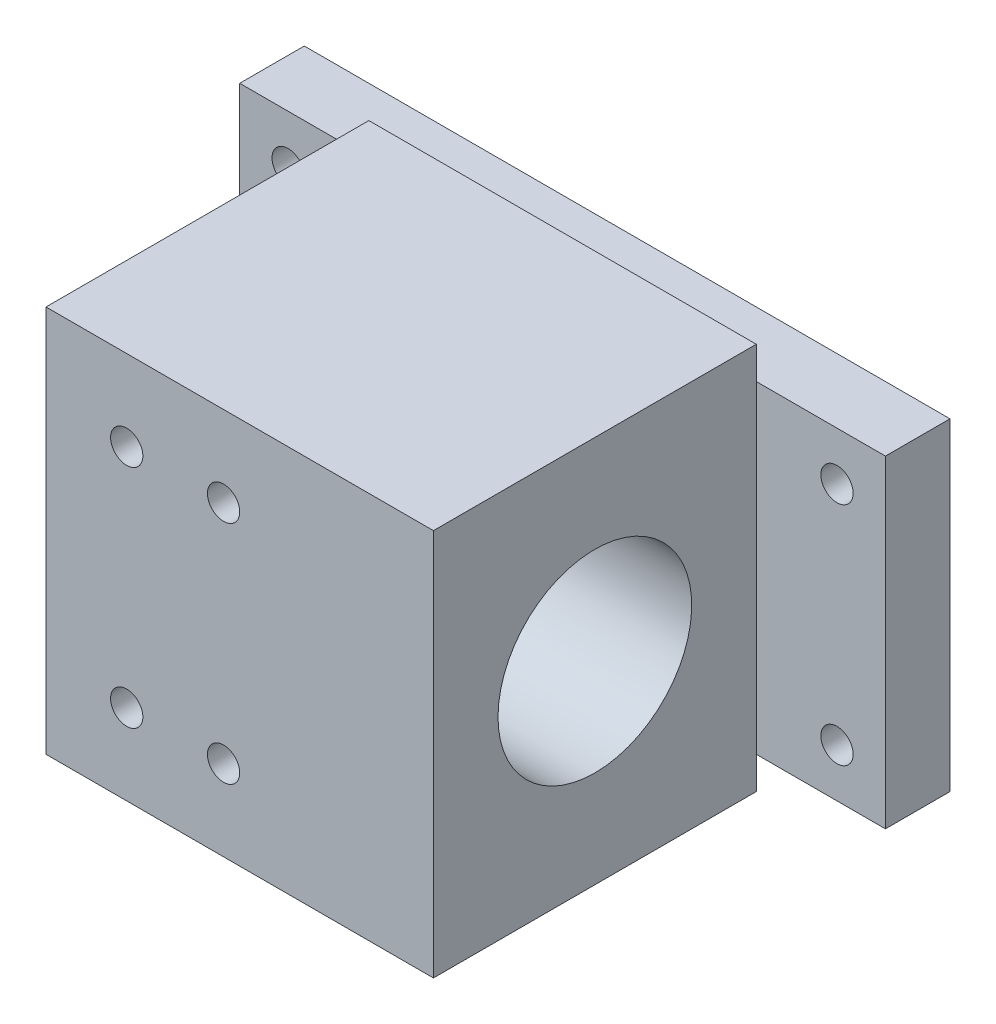
ISO-10303-21;
HEADER;
FILE_DESCRIPTION(('STEP AP214'),'2;1');
FILE_NAME('part.step','',(''),(''),'','','');
FILE_SCHEMA(('AUTOMOTIVE_DESIGN { 1 0 10303 214 1 1 1 1 }'));
ENDSEC;
DATA;
#1=APPLICATION_CONTEXT('core data for automotive mechanical design processes');
#2=APPLICATION_PROTOCOL_DEFINITION('international standard','automotive_design',2000,#1);
#3=PRODUCT_CONTEXT('',#1,'mechanical');
#4=PRODUCT('Part','Part','',(#3));
#5=PRODUCT_RELATED_PRODUCT_CATEGORY('part','',(#4));
#6=PRODUCT_DEFINITION_FORMATION('','',#4);
#7=PRODUCT_DEFINITION_CONTEXT('part definition',#1,'design');
#8=PRODUCT_DEFINITION('design','',#6,#7);
#9=PRODUCT_DEFINITION_SHAPE('','',#8);
#10=(LENGTH_UNIT() NAMED_UNIT(*) SI_UNIT(.MILLI.,.METRE.));
#11=(NAMED_UNIT(*) PLANE_ANGLE_UNIT() SI_UNIT($,.RADIAN.));
#12=(NAMED_UNIT(*) SI_UNIT($,.STERADIAN.) SOLID_ANGLE_UNIT());
#13=UNCERTAINTY_MEASURE_WITH_UNIT(LENGTH_MEASURE(1.E-05),#10,'distance_accuracy_value','');
#14=(GEOMETRIC_REPRESENTATION_CONTEXT(3) GLOBAL_UNCERTAINTY_ASSIGNED_CONTEXT((#13)) GLOBAL_UNIT_ASSIGNED_CONTEXT((#10,
#11,#12)) REPRESENTATION_CONTEXT('',''));
#15=CARTESIAN_POINT('',(0.,0.,0.));
#16=DIRECTION('',(0.,0.,1.));
#17=DIRECTION('',(1.,0.,0.));
#18=AXIS2_PLACEMENT_3D('',#15,#16,#17);
#19=CARTESIAN_POINT('',(0.,0.,10.));
#20=DIRECTION('',(0.,0.,1.));
#21=DIRECTION('',(1.,0.,0.));
#22=AXIS2_PLACEMENT_3D('',#19,#20,#21);
#23=PLANE('',#22);
#24=DIRECTION('',(0.,1.,0.));
#25=VECTOR('',#24,1.);
#26=CARTESIAN_POINT('',(30.,30.,10.));
#27=LINE('',#26,#25);
#28=CARTESIAN_POINT('',(30.,-25.,10.));
#29=VERTEX_POINT('',#28);
#30=CARTESIAN_POINT('',(30.,25.,10.));
#31=VERTEX_POINT('',#30);
#32=EDGE_CURVE('E11',#29,#31,#27,.T.);
#33=ORIENTED_EDGE('',*,*,#32,.F.);
#34=DIRECTION('',(1.,0.,0.));
#35=VECTOR('',#34,1.);
#36=CARTESIAN_POINT('',(-50.,-25.,10.));
#37=LINE('',#36,#35);
#38=CARTESIAN_POINT('',(50.,-25.,10.));
#39=VERTEX_POINT('',#38);
#40=EDGE_CURVE('E202',#29,#39,#37,.T.);
#41=ORIENTED_EDGE('',*,*,#40,.T.);
#42=DIRECTION('',(0.,1.,0.));
#43=VECTOR('',#42,1.);
#44=CARTESIAN_POINT('',(50.,25.,10.));
#45=LINE('',#44,#43);
#46=CARTESIAN_POINT('',(50.,25.,10.));
#47=VERTEX_POINT('',#46);
#48=EDGE_CURVE('E189',#39,#47,#45,.T.);
#49=ORIENTED_EDGE('',*,*,#48,.T.);
#50=DIRECTION('',(-1.,0.,0.));
#51=VECTOR('',#50,1.);
#52=CARTESIAN_POINT('',(-50.,25.,10.));
#53=LINE('',#52,#51);
#54=EDGE_CURVE('E195',#47,#31,#53,.T.);
#55=ORIENTED_EDGE('',*,*,#54,.T.);
#56=EDGE_LOOP('',(#33,#41,#49,#55));
#57=FACE_BOUND('',#56,.T.);
#58=CARTESIAN_POINT('',(42.5,17.5,10.));
#59=DIRECTION('',(0.,0.,1.));
#60=DIRECTION('',(1.,0.,0.));
#61=AXIS2_PLACEMENT_3D('',#58,#59,#60);
#62=CIRCLE('',#61,2.50000000000001);
#63=CARTESIAN_POINT('',(45.,17.5,10.));
#64=VERTEX_POINT('',#63);
#65=EDGE_CURVE('E173',#64,#64,#62,.T.);
#66=ORIENTED_EDGE('',*,*,#65,.F.);
#67=EDGE_LOOP('',(#66));
#68=FACE_BOUND('',#67,.T.);
#69=CARTESIAN_POINT('',(42.5,-17.5,10.));
#70=DIRECTION('',(0.,0.,1.));
#71=DIRECTION('',(1.,0.,0.));
#72=AXIS2_PLACEMENT_3D('',#69,#70,#71);
#73=CIRCLE('',#72,2.5);
#74=CARTESIAN_POINT('',(45.,-17.5,10.));
#75=VERTEX_POINT('',#74);
#76=EDGE_CURVE('E165',#75,#75,#73,.T.);
#77=ORIENTED_EDGE('',*,*,#76,.F.);
#78=EDGE_LOOP('',(#77));
#79=FACE_BOUND('',#78,.T.);
#80=ADVANCED_FACE('F42',(#57,#68,#79),#23,.T.);
#81=DIRECTION('',(0.,-1.,0.));
#82=VECTOR('',#81,1.);
#83=CARTESIAN_POINT('',(-30.,30.,10.));
#84=LINE('',#83,#82);
#85=CARTESIAN_POINT('',(-30.,25.,10.));
#86=VERTEX_POINT('',#85);
#87=CARTESIAN_POINT('',(-30.,-25.,10.));
#88=VERTEX_POINT('',#87);
#89=EDGE_CURVE('E52',#86,#88,#84,.T.);
#90=ORIENTED_EDGE('',*,*,#89,.F.);
#91=CARTESIAN_POINT('',(-50.,25.,10.));
#92=VERTEX_POINT('',#91);
#93=EDGE_CURVE('E193',#86,#92,#53,.T.);
#94=ORIENTED_EDGE('',*,*,#93,.T.);
#95=DIRECTION('',(0.,-1.,0.));
#96=VECTOR('',#95,1.);
#97=CARTESIAN_POINT('',(-50.,25.,10.));
#98=LINE('',#97,#96);
#99=CARTESIAN_POINT('',(-50.,-25.,10.));
#100=VERTEX_POINT('',#99);
#101=EDGE_CURVE('E198',#92,#100,#98,.T.);
#102=ORIENTED_EDGE('',*,*,#101,.T.);
#103=EDGE_CURVE('E203',#100,#88,#37,.T.);
#104=ORIENTED_EDGE('',*,*,#103,.T.);
#105=EDGE_LOOP('',(#90,#94,#102,#104));
#106=FACE_BOUND('',#105,.T.);
#107=CARTESIAN_POINT('',(-42.5,17.5,10.));
#108=DIRECTION('',(0.,0.,1.));
#109=DIRECTION('',(1.,0.,0.));
#110=AXIS2_PLACEMENT_3D('',#107,#108,#109);
#111=CIRCLE('',#110,2.50000000000001);
#112=CARTESIAN_POINT('',(-40.,17.5,10.));
#113=VERTEX_POINT('',#112);
#114=EDGE_CURVE('E181',#113,#113,#111,.T.);
#115=ORIENTED_EDGE('',*,*,#114,.F.);
#116=EDGE_LOOP('',(#115));
#117=FACE_BOUND('',#116,.T.);
#118=CARTESIAN_POINT('',(-42.5,-17.5,10.));
#119=DIRECTION('',(0.,0.,1.));
#120=DIRECTION('',(1.,0.,0.));
#121=AXIS2_PLACEMENT_3D('',#118,#119,#120);
#122=CIRCLE('',#121,2.5);
#123=CARTESIAN_POINT('',(-40.,-17.5,10.));
#124=VERTEX_POINT('',#123);
#125=EDGE_CURVE('E155',#124,#124,#122,.T.);
#126=ORIENTED_EDGE('',*,*,#125,.F.);
#127=EDGE_LOOP('',(#126));
#128=FACE_BOUND('',#127,.T.);
#129=ADVANCED_FACE('F324',(#106,#117,#128),#23,.T.);
#130=CARTESIAN_POINT('',(0.,0.,0.));
#131=DIRECTION('',(0.,0.,1.));
#132=DIRECTION('',(1.,0.,0.));
#133=AXIS2_PLACEMENT_3D('',#130,#131,#132);
#134=PLANE('',#133);
#135=DIRECTION('',(0.,1.,0.));
#136=VECTOR('',#135,1.);
#137=CARTESIAN_POINT('',(50.,25.,0.));
#138=LINE('',#137,#136);
#139=CARTESIAN_POINT('',(50.,-25.,0.));
#140=VERTEX_POINT('',#139);
#141=CARTESIAN_POINT('',(50.,25.,0.));
#142=VERTEX_POINT('',#141);
#143=EDGE_CURVE('E185',#140,#142,#138,.T.);
#144=ORIENTED_EDGE('',*,*,#143,.F.);
#145=DIRECTION('',(1.,0.,0.));
#146=VECTOR('',#145,1.);
#147=CARTESIAN_POINT('',(-50.,-25.,0.));
#148=LINE('',#147,#146);
#149=CARTESIAN_POINT('',(-50.,-25.,0.));
#150=VERTEX_POINT('',#149);
#151=EDGE_CURVE('E194',#150,#140,#148,.T.);
#152=ORIENTED_EDGE('',*,*,#151,.F.);
#153=DIRECTION('',(0.,-1.,0.));
#154=VECTOR('',#153,1.);
#155=CARTESIAN_POINT('',(-50.,25.,0.));
#156=LINE('',#155,#154);
#157=CARTESIAN_POINT('',(-50.,25.,0.));
#158=VERTEX_POINT('',#157);
#159=EDGE_CURVE('E214',#158,#150,#156,.T.);
#160=ORIENTED_EDGE('',*,*,#159,.F.);
#161=DIRECTION('',(-1.,0.,0.));
#162=VECTOR('',#161,1.);
#163=CARTESIAN_POINT('',(-50.,25.,0.));
#164=LINE('',#163,#162);
#165=EDGE_CURVE('E211',#142,#158,#164,.T.);
#166=ORIENTED_EDGE('',*,*,#165,.F.);
#167=EDGE_LOOP('',(#144,#152,#160,#166));
#168=FACE_BOUND('',#167,.T.);
#169=CARTESIAN_POINT('',(-42.5,17.5,0.));
#170=DIRECTION('',(0.,0.,1.));
#171=DIRECTION('',(1.,0.,0.));
#172=AXIS2_PLACEMENT_3D('',#169,#170,#171);
#173=CIRCLE('',#172,2.50000000000001);
#174=CARTESIAN_POINT('',(-40.,17.5,0.));
#175=VERTEX_POINT('',#174);
#176=EDGE_CURVE('E177',#175,#175,#173,.T.);
#177=ORIENTED_EDGE('',*,*,#176,.T.);
#178=EDGE_LOOP('',(#177));
#179=FACE_BOUND('',#178,.T.);
#180=CARTESIAN_POINT('',(42.5,17.5,0.));
#181=DIRECTION('',(0.,0.,1.));
#182=DIRECTION('',(1.,0.,0.));
#183=AXIS2_PLACEMENT_3D('',#180,#181,#182);
#184=CIRCLE('',#183,2.50000000000001);
#185=CARTESIAN_POINT('',(45.,17.5,0.));
#186=VERTEX_POINT('',#185);
#187=EDGE_CURVE('E169',#186,#186,#184,.T.);
#188=ORIENTED_EDGE('',*,*,#187,.T.);
#189=EDGE_LOOP('',(#188));
#190=FACE_BOUND('',#189,.T.);
#191=CARTESIAN_POINT('',(42.5,-17.5,0.));
#192=DIRECTION('',(0.,0.,1.));
#193=DIRECTION('',(1.,0.,0.));
#194=AXIS2_PLACEMENT_3D('',#191,#192,#193);
#195=CIRCLE('',#194,2.5);
#196=CARTESIAN_POINT('',(45.,-17.5,0.));
#197=VERTEX_POINT('',#196);
#198=EDGE_CURVE('E163',#197,#197,#195,.T.);
#199=ORIENTED_EDGE('',*,*,#198,.T.);
#200=EDGE_LOOP('',(#199));
#201=FACE_BOUND('',#200,.T.);
#202=CARTESIAN_POINT('',(-42.5,-17.5,0.));
#203=DIRECTION('',(0.,0.,1.));
#204=DIRECTION('',(1.,0.,0.));
#205=AXIS2_PLACEMENT_3D('',#202,#203,#204);
#206=CIRCLE('',#205,2.5);
#207=CARTESIAN_POINT('',(-40.,-17.5,0.));
#208=VERTEX_POINT('',#207);
#209=EDGE_CURVE('E150',#208,#208,#206,.T.);
#210=ORIENTED_EDGE('',*,*,#209,.T.);
#211=EDGE_LOOP('',(#210));
#212=FACE_BOUND('',#211,.T.);
#213=ADVANCED_FACE('F329',(#168,#179,#190,#201,#212),#134,.F.);
#214=CARTESIAN_POINT('',(50.,25.,10.));
#215=DIRECTION('',(-1.,0.,0.));
#216=DIRECTION('',(0.,-1.,0.));
#217=AXIS2_PLACEMENT_3D('',#214,#215,#216);
#218=PLANE('',#217);
#219=ORIENTED_EDGE('',*,*,#143,.T.);
#220=DIRECTION('',(0.,0.,-1.));
#221=VECTOR('',#220,1.);
#222=CARTESIAN_POINT('',(50.,25.,10.));
#223=LINE('',#222,#221);
#224=EDGE_CURVE('E46',#47,#142,#223,.T.);
#225=ORIENTED_EDGE('',*,*,#224,.F.);
#226=ORIENTED_EDGE('',*,*,#48,.F.);
#227=DIRECTION('',(0.,0.,-1.));
#228=VECTOR('',#227,1.);
#229=CARTESIAN_POINT('',(50.,-25.,10.));
#230=LINE('',#229,#228);
#231=EDGE_CURVE('E206',#39,#140,#230,.T.);
#232=ORIENTED_EDGE('',*,*,#231,.T.);
#233=EDGE_LOOP('',(#219,#225,#226,#232));
#234=FACE_BOUND('',#233,.T.);
#235=ADVANCED_FACE('F44',(#234),#218,.F.);
#236=CARTESIAN_POINT('',(-50.,25.,10.));
#237=DIRECTION('',(0.,-1.,0.));
#238=DIRECTION('',(0.,0.,-1.));
#239=AXIS2_PLACEMENT_3D('',#236,#237,#238);
#240=PLANE('',#239);
#241=ORIENTED_EDGE('',*,*,#165,.T.);
#242=DIRECTION('',(0.,0.,-1.));
#243=VECTOR('',#242,1.);
#244=CARTESIAN_POINT('',(-50.,25.,10.));
#245=LINE('',#244,#243);
#246=EDGE_CURVE('E225',#92,#158,#245,.T.);
#247=ORIENTED_EDGE('',*,*,#246,.F.);
#248=ORIENTED_EDGE('',*,*,#93,.F.);
#249=EDGE_CURVE('E199',#31,#86,#53,.T.);
#250=ORIENTED_EDGE('',*,*,#249,.F.);
#251=ORIENTED_EDGE('',*,*,#54,.F.);
#252=ORIENTED_EDGE('',*,*,#224,.T.);
#253=EDGE_LOOP('',(#241,#247,#248,#250,#251,#252));
#254=FACE_BOUND('',#253,.T.);
#255=ADVANCED_FACE('F344',(#254),#240,.F.);
#256=CARTESIAN_POINT('',(-50.,25.,10.));
#257=DIRECTION('',(1.,0.,0.));
#258=DIRECTION('',(0.,1.,0.));
#259=AXIS2_PLACEMENT_3D('',#256,#257,#258);
#260=PLANE('',#259);
#261=ORIENTED_EDGE('',*,*,#159,.T.);
#262=DIRECTION('',(0.,0.,-1.));
#263=VECTOR('',#262,1.);
#264=CARTESIAN_POINT('',(-50.,-25.,10.));
#265=LINE('',#264,#263);
#266=EDGE_CURVE('E222',#100,#150,#265,.T.);
#267=ORIENTED_EDGE('',*,*,#266,.F.);
#268=ORIENTED_EDGE('',*,*,#101,.F.);
#269=ORIENTED_EDGE('',*,*,#246,.T.);
#270=EDGE_LOOP('',(#261,#267,#268,#269));
#271=FACE_BOUND('',#270,.T.);
#272=ADVANCED_FACE('F341',(#271),#260,.F.);
#273=CARTESIAN_POINT('',(-50.,-25.,10.));
#274=DIRECTION('',(0.,1.,0.));
#275=DIRECTION('',(0.,0.,1.));
#276=AXIS2_PLACEMENT_3D('',#273,#274,#275);
#277=PLANE('',#276);
#278=ORIENTED_EDGE('',*,*,#151,.T.);
#279=ORIENTED_EDGE('',*,*,#231,.F.);
#280=ORIENTED_EDGE('',*,*,#40,.F.);
#281=EDGE_CURVE('E207',#88,#29,#37,.T.);
#282=ORIENTED_EDGE('',*,*,#281,.F.);
#283=ORIENTED_EDGE('',*,*,#103,.F.);
#284=ORIENTED_EDGE('',*,*,#266,.T.);
#285=EDGE_LOOP('',(#278,#279,#280,#282,#283,#284));
#286=FACE_BOUND('',#285,.T.);
#287=ADVANCED_FACE('F338',(#286),#277,.F.);
#288=CARTESIAN_POINT('',(-42.5,17.5,10.));
#289=DIRECTION('',(0.,0.,-1.));
#290=DIRECTION('',(-1.,0.,0.));
#291=AXIS2_PLACEMENT_3D('',#288,#289,#290);
#292=CYLINDRICAL_SURFACE('',#291,2.50000000000001);
#293=ORIENTED_EDGE('',*,*,#114,.T.);
#294=EDGE_LOOP('',(#293));
#295=FACE_BOUND('',#294,.T.);
#296=ORIENTED_EDGE('',*,*,#176,.F.);
#297=EDGE_LOOP('',(#296));
#298=FACE_BOUND('',#297,.T.);
#299=ADVANCED_FACE('F333',(#295,#298),#292,.F.);
#300=CARTESIAN_POINT('',(42.5,17.5,10.));
#301=DIRECTION('',(0.,0.,-1.));
#302=DIRECTION('',(-1.,0.,0.));
#303=AXIS2_PLACEMENT_3D('',#300,#301,#302);
#304=CYLINDRICAL_SURFACE('',#303,2.50000000000001);
#305=ORIENTED_EDGE('',*,*,#65,.T.);
#306=EDGE_LOOP('',(#305));
#307=FACE_BOUND('',#306,.T.);
#308=ORIENTED_EDGE('',*,*,#187,.F.);
#309=EDGE_LOOP('',(#308));
#310=FACE_BOUND('',#309,.T.);
#311=ADVANCED_FACE('F400',(#307,#310),#304,.F.);
#312=CARTESIAN_POINT('',(42.5,-17.5,10.));
#313=DIRECTION('',(0.,0.,-1.));
#314=DIRECTION('',(-1.,0.,0.));
#315=AXIS2_PLACEMENT_3D('',#312,#313,#314);
#316=CYLINDRICAL_SURFACE('',#315,2.5);
#317=ORIENTED_EDGE('',*,*,#76,.T.);
#318=EDGE_LOOP('',(#317));
#319=FACE_BOUND('',#318,.T.);
#320=ORIENTED_EDGE('',*,*,#198,.F.);
#321=EDGE_LOOP('',(#320));
#322=FACE_BOUND('',#321,.T.);
#323=ADVANCED_FACE('F397',(#319,#322),#316,.F.);
#324=CARTESIAN_POINT('',(-42.5,-17.5,10.));
#325=DIRECTION('',(0.,0.,-1.));
#326=DIRECTION('',(-1.,0.,0.));
#327=AXIS2_PLACEMENT_3D('',#324,#325,#326);
#328=CYLINDRICAL_SURFACE('',#327,2.5);
#329=ORIENTED_EDGE('',*,*,#125,.T.);
#330=EDGE_LOOP('',(#329));
#331=FACE_BOUND('',#330,.T.);
#332=ORIENTED_EDGE('',*,*,#209,.F.);
#333=EDGE_LOOP('',(#332));
#334=FACE_BOUND('',#333,.T.);
#335=ADVANCED_FACE('F386',(#331,#334),#328,.F.);
#336=CARTESIAN_POINT('',(0.,0.,10.));
#337=DIRECTION('',(0.,0.,1.));
#338=DIRECTION('',(1.,0.,0.));
#339=AXIS2_PLACEMENT_3D('',#336,#337,#338);
#340=PLANE('',#339);
#341=CARTESIAN_POINT('',(30.,30.,10.));
#342=VERTEX_POINT('',#341);
#343=EDGE_CURVE('E55',#31,#342,#27,.T.);
#344=ORIENTED_EDGE('',*,*,#343,.F.);
#345=ORIENTED_EDGE('',*,*,#249,.T.);
#346=CARTESIAN_POINT('',(-30.,30.,10.));
#347=VERTEX_POINT('',#346);
#348=EDGE_CURVE('E238',#347,#86,#84,.T.);
#349=ORIENTED_EDGE('',*,*,#348,.F.);
#350=DIRECTION('',(-1.,0.,0.));
#351=VECTOR('',#350,1.);
#352=CARTESIAN_POINT('',(-30.,30.,10.));
#353=LINE('',#352,#351);
#354=EDGE_CURVE('E246',#342,#347,#353,.T.);
#355=ORIENTED_EDGE('',*,*,#354,.F.);
#356=EDGE_LOOP('',(#344,#345,#349,#355));
#357=FACE_BOUND('',#356,.T.);
#358=ADVANCED_FACE('F364',(#357),#340,.F.);
#359=CARTESIAN_POINT('',(-30.,-30.,10.));
#360=VERTEX_POINT('',#359);
#361=EDGE_CURVE('E239',#88,#360,#84,.T.);
#362=ORIENTED_EDGE('',*,*,#361,.F.);
#363=ORIENTED_EDGE('',*,*,#281,.T.);
#364=CARTESIAN_POINT('',(30.,-30.,10.));
#365=VERTEX_POINT('',#364);
#366=EDGE_CURVE('E54',#365,#29,#27,.T.);
#367=ORIENTED_EDGE('',*,*,#366,.F.);
#368=DIRECTION('',(1.,0.,0.));
#369=VECTOR('',#368,1.);
#370=CARTESIAN_POINT('',(-30.,-30.,10.));
#371=LINE('',#370,#369);
#372=EDGE_CURVE('E143',#360,#365,#371,.T.);
#373=ORIENTED_EDGE('',*,*,#372,.F.);
#374=EDGE_LOOP('',(#362,#363,#367,#373));
#375=FACE_BOUND('',#374,.T.);
#376=ADVANCED_FACE('F374',(#375),#340,.F.);
#377=CARTESIAN_POINT('',(30.,30.,60.));
#378=DIRECTION('',(-1.,0.,0.));
#379=DIRECTION('',(0.,0.,1.));
#380=AXIS2_PLACEMENT_3D('',#377,#378,#379);
#381=PLANE('',#380);
#382=CARTESIAN_POINT('',(30.,0.,35.));
#383=DIRECTION('',(-1.,0.,0.));
#384=DIRECTION('',(0.,0.,1.));
#385=AXIS2_PLACEMENT_3D('',#382,#383,#384);
#386=CIRCLE('',#385,15.);
#387=CARTESIAN_POINT('',(30.,0.,50.));
#388=VERTEX_POINT('',#387);
#389=EDGE_CURVE('E258',#388,#388,#386,.T.);
#390=ORIENTED_EDGE('',*,*,#389,.T.);
#391=EDGE_LOOP('',(#390));
#392=FACE_BOUND('',#391,.T.);
#393=ORIENTED_EDGE('',*,*,#366,.T.);
#394=ORIENTED_EDGE('',*,*,#32,.T.);
#395=ORIENTED_EDGE('',*,*,#343,.T.);
#396=DIRECTION('',(0.,0.,-1.));
#397=VECTOR('',#396,1.);
#398=CARTESIAN_POINT('',(30.,30.,60.));
#399=LINE('',#398,#397);
#400=CARTESIAN_POINT('',(30.,30.,60.));
#401=VERTEX_POINT('',#400);
#402=EDGE_CURVE('E126',#401,#342,#399,.T.);
#403=ORIENTED_EDGE('',*,*,#402,.F.);
#404=DIRECTION('',(0.,1.,0.));
#405=VECTOR('',#404,1.);
#406=CARTESIAN_POINT('',(30.,30.,60.));
#407=LINE('',#406,#405);
#408=CARTESIAN_POINT('',(30.,-30.,60.));
#409=VERTEX_POINT('',#408);
#410=EDGE_CURVE('E133',#409,#401,#407,.T.);
#411=ORIENTED_EDGE('',*,*,#410,.F.);
#412=DIRECTION('',(0.,0.,-1.));
#413=VECTOR('',#412,1.);
#414=CARTESIAN_POINT('',(30.,-30.,60.));
#415=LINE('',#414,#413);
#416=EDGE_CURVE('E255',#409,#365,#415,.T.);
#417=ORIENTED_EDGE('',*,*,#416,.T.);
#418=EDGE_LOOP('',(#393,#394,#395,#403,#411,#417));
#419=FACE_BOUND('',#418,.T.);
#420=ADVANCED_FACE('F146',(#392,#419),#381,.F.);
#421=CARTESIAN_POINT('',(-30.,30.,60.));
#422=DIRECTION('',(0.,-1.,0.));
#423=DIRECTION('',(0.,0.,-1.));
#424=AXIS2_PLACEMENT_3D('',#421,#422,#423);
#425=PLANE('',#424);
#426=ORIENTED_EDGE('',*,*,#354,.T.);
#427=DIRECTION('',(0.,0.,-1.));
#428=VECTOR('',#427,1.);
#429=CARTESIAN_POINT('',(-30.,30.,60.));
#430=LINE('',#429,#428);
#431=CARTESIAN_POINT('',(-30.,30.,60.));
#432=VERTEX_POINT('',#431);
#433=EDGE_CURVE('E128',#432,#347,#430,.T.);
#434=ORIENTED_EDGE('',*,*,#433,.F.);
#435=DIRECTION('',(-1.,0.,0.));
#436=VECTOR('',#435,1.);
#437=CARTESIAN_POINT('',(-30.,30.,60.));
#438=LINE('',#437,#436);
#439=EDGE_CURVE('E122',#401,#432,#438,.T.);
#440=ORIENTED_EDGE('',*,*,#439,.F.);
#441=ORIENTED_EDGE('',*,*,#402,.T.);
#442=EDGE_LOOP('',(#426,#434,#440,#441));
#443=FACE_BOUND('',#442,.T.);
#444=ADVANCED_FACE('F124',(#443),#425,.F.);
#445=CARTESIAN_POINT('',(-30.,30.,60.));
#446=DIRECTION('',(1.,0.,0.));
#447=DIRECTION('',(0.,0.,-1.));
#448=AXIS2_PLACEMENT_3D('',#445,#446,#447);
#449=PLANE('',#448);
#450=CARTESIAN_POINT('',(-30.,0.,35.));
#451=DIRECTION('',(-1.,0.,0.));
#452=DIRECTION('',(0.,-1.,0.));
#453=AXIS2_PLACEMENT_3D('',#450,#451,#452);
#454=CIRCLE('',#453,15.);
#455=CARTESIAN_POINT('',(-30.,-15.,35.));
#456=VERTEX_POINT('',#455);
#457=EDGE_CURVE('E262',#456,#456,#454,.T.);
#458=ORIENTED_EDGE('',*,*,#457,.F.);
#459=EDGE_LOOP('',(#458));
#460=FACE_BOUND('',#459,.T.);
#461=ORIENTED_EDGE('',*,*,#348,.T.);
#462=ORIENTED_EDGE('',*,*,#89,.T.);
#463=ORIENTED_EDGE('',*,*,#361,.T.);
#464=DIRECTION('',(0.,0.,-1.));
#465=VECTOR('',#464,1.);
#466=CARTESIAN_POINT('',(-30.,-30.,60.));
#467=LINE('',#466,#465);
#468=CARTESIAN_POINT('',(-30.,-30.,60.));
#469=VERTEX_POINT('',#468);
#470=EDGE_CURVE('E157',#469,#360,#467,.T.);
#471=ORIENTED_EDGE('',*,*,#470,.F.);
#472=DIRECTION('',(0.,-1.,0.));
#473=VECTOR('',#472,1.);
#474=CARTESIAN_POINT('',(-30.,30.,60.));
#475=LINE('',#474,#473);
#476=EDGE_CURVE('E132',#432,#469,#475,.T.);
#477=ORIENTED_EDGE('',*,*,#476,.F.);
#478=ORIENTED_EDGE('',*,*,#433,.T.);
#479=EDGE_LOOP('',(#461,#462,#463,#471,#477,#478));
#480=FACE_BOUND('',#479,.T.);
#481=ADVANCED_FACE('F365',(#460,#480),#449,.F.);
#482=CARTESIAN_POINT('',(-30.,-30.,60.));
#483=DIRECTION('',(0.,1.,0.));
#484=DIRECTION('',(0.,0.,1.));
#485=AXIS2_PLACEMENT_3D('',#482,#483,#484);
#486=PLANE('',#485);
#487=ORIENTED_EDGE('',*,*,#372,.T.);
#488=ORIENTED_EDGE('',*,*,#416,.F.);
#489=DIRECTION('',(1.,0.,0.));
#490=VECTOR('',#489,1.);
#491=CARTESIAN_POINT('',(-30.,-30.,60.));
#492=LINE('',#491,#490);
#493=EDGE_CURVE('E138',#469,#409,#492,.T.);
#494=ORIENTED_EDGE('',*,*,#493,.F.);
#495=ORIENTED_EDGE('',*,*,#470,.T.);
#496=EDGE_LOOP('',(#487,#488,#494,#495));
#497=FACE_BOUND('',#496,.T.);
#498=ADVANCED_FACE('F304',(#497),#486,.F.);
#499=CARTESIAN_POINT('',(0.,0.,60.));
#500=DIRECTION('',(0.,0.,1.));
#501=DIRECTION('',(1.,0.,0.));
#502=AXIS2_PLACEMENT_3D('',#499,#500,#501);
#503=PLANE('',#502);
#504=CARTESIAN_POINT('',(-17.5,-17.5,60.));
#505=DIRECTION('',(0.,0.,1.));
#506=DIRECTION('',(1.,0.,0.));
#507=AXIS2_PLACEMENT_3D('',#504,#505,#506);
#508=CIRCLE('',#507,2.5);
#509=CARTESIAN_POINT('',(-15.,-17.5,60.));
#510=VERTEX_POINT('',#509);
#511=EDGE_CURVE('E279',#510,#510,#508,.T.);
#512=ORIENTED_EDGE('',*,*,#511,.F.);
#513=EDGE_LOOP('',(#512));
#514=FACE_BOUND('',#513,.T.);
#515=CARTESIAN_POINT('',(-2.49999999999998,-17.5,60.));
#516=DIRECTION('',(0.,0.,1.));
#517=DIRECTION('',(1.,0.,0.));
#518=AXIS2_PLACEMENT_3D('',#515,#516,#517);
#519=CIRCLE('',#518,2.5);
#520=CARTESIAN_POINT('',(0.,-17.5,60.));
#521=VERTEX_POINT('',#520);
#522=EDGE_CURVE('E287',#521,#521,#519,.T.);
#523=ORIENTED_EDGE('',*,*,#522,.F.);
#524=EDGE_LOOP('',(#523));
#525=FACE_BOUND('',#524,.T.);
#526=CARTESIAN_POINT('',(-2.49999999999998,17.5,60.));
#527=DIRECTION('',(0.,0.,1.));
#528=DIRECTION('',(1.,0.,0.));
#529=AXIS2_PLACEMENT_3D('',#526,#527,#528);
#530=CIRCLE('',#529,2.5);
#531=CARTESIAN_POINT('',(0.,17.5,60.));
#532=VERTEX_POINT('',#531);
#533=EDGE_CURVE('E271',#532,#532,#530,.T.);
#534=ORIENTED_EDGE('',*,*,#533,.F.);
#535=EDGE_LOOP('',(#534));
#536=FACE_BOUND('',#535,.T.);
#537=CARTESIAN_POINT('',(-17.5,17.5,60.));
#538=DIRECTION('',(0.,0.,1.));
#539=DIRECTION('',(1.,0.,0.));
#540=AXIS2_PLACEMENT_3D('',#537,#538,#539);
#541=CIRCLE('',#540,2.5);
#542=CARTESIAN_POINT('',(-15.,17.5,60.));
#543=VERTEX_POINT('',#542);
#544=EDGE_CURVE('E267',#543,#543,#541,.T.);
#545=ORIENTED_EDGE('',*,*,#544,.F.);
#546=EDGE_LOOP('',(#545));
#547=FACE_BOUND('',#546,.T.);
#548=ORIENTED_EDGE('',*,*,#410,.T.);
#549=ORIENTED_EDGE('',*,*,#439,.T.);
#550=ORIENTED_EDGE('',*,*,#476,.T.);
#551=ORIENTED_EDGE('',*,*,#493,.T.);
#552=EDGE_LOOP('',(#548,#549,#550,#551));
#553=FACE_BOUND('',#552,.T.);
#554=ADVANCED_FACE('F136',(#514,#525,#536,#547,#553),#503,.T.);
#555=CARTESIAN_POINT('',(71.,0.,35.));
#556=DIRECTION('',(-1.,0.,0.));
#557=DIRECTION('',(0.,-1.,0.));
#558=AXIS2_PLACEMENT_3D('',#555,#556,#557);
#559=CYLINDRICAL_SURFACE('',#558,15.);
#560=ORIENTED_EDGE('',*,*,#457,.T.);
#561=EDGE_LOOP('',(#560));
#562=FACE_BOUND('',#561,.T.);
#563=ORIENTED_EDGE('',*,*,#389,.F.);
#564=EDGE_LOOP('',(#563));
#565=FACE_BOUND('',#564,.T.);
#566=ADVANCED_FACE('F303',(#562,#565),#559,.F.);
#567=CARTESIAN_POINT('',(-17.5,17.5,50.));
#568=DIRECTION('',(0.,0.,1.));
#569=DIRECTION('',(1.,0.,0.));
#570=AXIS2_PLACEMENT_3D('',#567,#568,#569);
#571=CYLINDRICAL_SURFACE('',#570,2.5);
#572=CARTESIAN_POINT('',(-17.5,17.5,50.));
#573=DIRECTION('',(0.,0.,1.));
#574=DIRECTION('',(1.,0.,0.));
#575=AXIS2_PLACEMENT_3D('',#572,#573,#574);
#576=CIRCLE('',#575,2.5);
#577=CARTESIAN_POINT('',(-15.,17.5,50.));
#578=VERTEX_POINT('',#577);
#579=EDGE_CURVE('E266',#578,#578,#576,.T.);
#580=ORIENTED_EDGE('',*,*,#579,.F.);
#581=EDGE_LOOP('',(#580));
#582=FACE_BOUND('',#581,.T.);
#583=ORIENTED_EDGE('',*,*,#544,.T.);
#584=EDGE_LOOP('',(#583));
#585=FACE_BOUND('',#584,.T.);
#586=ADVANCED_FACE('F309',(#582,#585),#571,.F.);
#587=CARTESIAN_POINT('',(-17.5,17.5,50.));
#588=DIRECTION('',(0.,0.,1.));
#589=DIRECTION('',(1.,0.,0.));
#590=AXIS2_PLACEMENT_3D('',#587,#588,#589);
#591=PLANE('',#590);
#592=ORIENTED_EDGE('',*,*,#579,.T.);
#593=EDGE_LOOP('',(#592));
#594=FACE_BOUND('',#593,.T.);
#595=ADVANCED_FACE('F311',(#594),#591,.T.);
#596=CARTESIAN_POINT('',(-2.49999999999998,17.5,50.));
#597=DIRECTION('',(0.,0.,1.));
#598=DIRECTION('',(1.,0.,0.));
#599=AXIS2_PLACEMENT_3D('',#596,#597,#598);
#600=CYLINDRICAL_SURFACE('',#599,2.5);
#601=CARTESIAN_POINT('',(-2.49999999999998,17.5,50.));
#602=DIRECTION('',(0.,0.,1.));
#603=DIRECTION('',(1.,0.,0.));
#604=AXIS2_PLACEMENT_3D('',#601,#602,#603);
#605=CIRCLE('',#604,2.5);
#606=CARTESIAN_POINT('',(0.,17.5,50.));
#607=VERTEX_POINT('',#606);
#608=EDGE_CURVE('E291',#607,#607,#605,.T.);
#609=ORIENTED_EDGE('',*,*,#608,.F.);
#610=EDGE_LOOP('',(#609));
#611=FACE_BOUND('',#610,.T.);
#612=ORIENTED_EDGE('',*,*,#533,.T.);
#613=EDGE_LOOP('',(#612));
#614=FACE_BOUND('',#613,.T.);
#615=ADVANCED_FACE('F299',(#611,#614),#600,.F.);
#616=CARTESIAN_POINT('',(-2.49999999999998,17.5,50.));
#617=DIRECTION('',(0.,0.,1.));
#618=DIRECTION('',(1.,0.,0.));
#619=AXIS2_PLACEMENT_3D('',#616,#617,#618);
#620=PLANE('',#619);
#621=ORIENTED_EDGE('',*,*,#608,.T.);
#622=EDGE_LOOP('',(#621));
#623=FACE_BOUND('',#622,.T.);
#624=ADVANCED_FACE('F563',(#623),#620,.T.);
#625=CARTESIAN_POINT('',(-2.49999999999998,-17.5,50.));
#626=DIRECTION('',(0.,0.,1.));
#627=DIRECTION('',(1.,0.,0.));
#628=AXIS2_PLACEMENT_3D('',#625,#626,#627);
#629=CYLINDRICAL_SURFACE('',#628,2.5);
#630=CARTESIAN_POINT('',(-2.49999999999998,-17.5,50.));
#631=DIRECTION('',(0.,0.,1.));
#632=DIRECTION('',(1.,0.,0.));
#633=AXIS2_PLACEMENT_3D('',#630,#631,#632);
#634=CIRCLE('',#633,2.5);
#635=CARTESIAN_POINT('',(0.,-17.5,50.));
#636=VERTEX_POINT('',#635);
#637=EDGE_CURVE('E283',#636,#636,#634,.T.);
#638=ORIENTED_EDGE('',*,*,#637,.F.);
#639=EDGE_LOOP('',(#638));
#640=FACE_BOUND('',#639,.T.);
#641=ORIENTED_EDGE('',*,*,#522,.T.);
#642=EDGE_LOOP('',(#641));
#643=FACE_BOUND('',#642,.T.);
#644=ADVANCED_FACE('F573',(#640,#643),#629,.F.);
#645=CARTESIAN_POINT('',(-2.49999999999998,-17.5,50.));
#646=DIRECTION('',(0.,0.,1.));
#647=DIRECTION('',(1.,0.,0.));
#648=AXIS2_PLACEMENT_3D('',#645,#646,#647);
#649=PLANE('',#648);
#650=ORIENTED_EDGE('',*,*,#637,.T.);
#651=EDGE_LOOP('',(#650));
#652=FACE_BOUND('',#651,.T.);
#653=ADVANCED_FACE('F583',(#652),#649,.T.);
#654=CARTESIAN_POINT('',(-17.5,-17.5,50.));
#655=DIRECTION('',(0.,0.,1.));
#656=DIRECTION('',(1.,0.,0.));
#657=AXIS2_PLACEMENT_3D('',#654,#655,#656);
#658=CYLINDRICAL_SURFACE('',#657,2.5);
#659=CARTESIAN_POINT('',(-17.5,-17.5,50.));
#660=DIRECTION('',(0.,0.,1.));
#661=DIRECTION('',(1.,0.,0.));
#662=AXIS2_PLACEMENT_3D('',#659,#660,#661);
#663=CIRCLE('',#662,2.5);
#664=CARTESIAN_POINT('',(-15.,-17.5,50.));
#665=VERTEX_POINT('',#664);
#666=EDGE_CURVE('E275',#665,#665,#663,.T.);
#667=ORIENTED_EDGE('',*,*,#666,.F.);
#668=EDGE_LOOP('',(#667));
#669=FACE_BOUND('',#668,.T.);
#670=ORIENTED_EDGE('',*,*,#511,.T.);
#671=EDGE_LOOP('',(#670));
#672=FACE_BOUND('',#671,.T.);
#673=ADVANCED_FACE('F593',(#669,#672),#658,.F.);
#674=CARTESIAN_POINT('',(-17.5,-17.5,50.));
#675=DIRECTION('',(0.,0.,1.));
#676=DIRECTION('',(1.,0.,0.));
#677=AXIS2_PLACEMENT_3D('',#674,#675,#676);
#678=PLANE('',#677);
#679=ORIENTED_EDGE('',*,*,#666,.T.);
#680=EDGE_LOOP('',(#679));
#681=FACE_BOUND('',#680,.T.);
#682=ADVANCED_FACE('F603',(#681),#678,.T.);
#683=CLOSED_SHELL('',(#80,#129,#213,#235,#255,#272,#287,#299,#311,#323,#335,#358,#376,#420,#444,
#481,#498,#554,#566,#586,#595,#615,#624,#644,#653,#673,#682));
#684=MANIFOLD_SOLID_BREP('B2',#683);
#685=ADVANCED_BREP_SHAPE_REPRESENTATION('',(#18,#684),#14);
#686=SHAPE_DEFINITION_REPRESENTATION(#9,#685);
ENDSEC;
END-ISO-10303-21;
